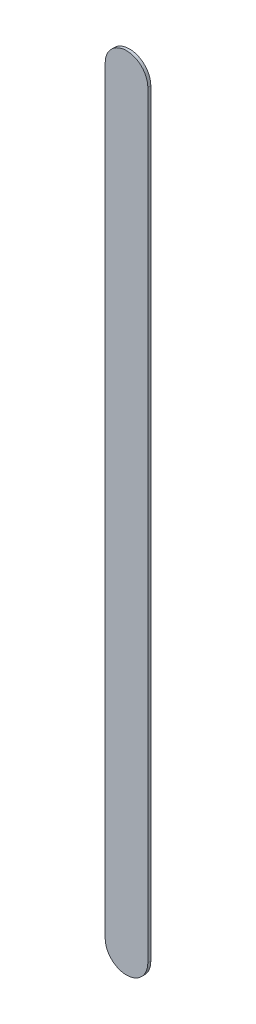
ISO-10303-21;
HEADER;
FILE_DESCRIPTION(('STEP AP214'),'2;1');
FILE_NAME('part.step','',(''),(''),'','','');
FILE_SCHEMA(('AUTOMOTIVE_DESIGN { 1 0 10303 214 1 1 1 1 }'));
ENDSEC;
DATA;
#1=APPLICATION_CONTEXT('core data for automotive mechanical design processes');
#2=APPLICATION_PROTOCOL_DEFINITION('international standard','automotive_design',2000,#1);
#3=PRODUCT_CONTEXT('',#1,'mechanical');
#4=PRODUCT('Part','Part','',(#3));
#5=PRODUCT_RELATED_PRODUCT_CATEGORY('part','',(#4));
#6=PRODUCT_DEFINITION_FORMATION('','',#4);
#7=PRODUCT_DEFINITION_CONTEXT('part definition',#1,'design');
#8=PRODUCT_DEFINITION('design','',#6,#7);
#9=PRODUCT_DEFINITION_SHAPE('','',#8);
#10=(LENGTH_UNIT() NAMED_UNIT(*) SI_UNIT(.MILLI.,.METRE.));
#11=(NAMED_UNIT(*) PLANE_ANGLE_UNIT() SI_UNIT($,.RADIAN.));
#12=(NAMED_UNIT(*) SI_UNIT($,.STERADIAN.) SOLID_ANGLE_UNIT());
#13=UNCERTAINTY_MEASURE_WITH_UNIT(LENGTH_MEASURE(1.E-05),#10,'distance_accuracy_value','');
#14=(GEOMETRIC_REPRESENTATION_CONTEXT(3) GLOBAL_UNCERTAINTY_ASSIGNED_CONTEXT((#13)) GLOBAL_UNIT_ASSIGNED_CONTEXT((#10,
#11,#12)) REPRESENTATION_CONTEXT('',''));
#15=CARTESIAN_POINT('',(0.,0.,0.));
#16=DIRECTION('',(0.,0.,1.));
#17=DIRECTION('',(1.,0.,0.));
#18=AXIS2_PLACEMENT_3D('',#15,#16,#17);
#19=CARTESIAN_POINT('',(164.596,-114.554,0.));
#20=DIRECTION('',(0.,0.,1.));
#21=DIRECTION('',(1.,0.,0.));
#22=AXIS2_PLACEMENT_3D('',#19,#20,#21);
#23=PLANE('',#22);
#24=DIRECTION('',(0.,-1.,0.));
#25=VECTOR('',#24,1.);
#26=CARTESIAN_POINT('',(164.596,-114.554,0.));
#27=LINE('',#26,#25);
#28=CARTESIAN_POINT('',(164.596,-114.554,0.));
#29=VERTEX_POINT('',#28);
#30=CARTESIAN_POINT('',(164.596,-123.444,0.));
#31=VERTEX_POINT('',#30);
#32=EDGE_CURVE('E83',#29,#31,#27,.T.);
#33=ORIENTED_EDGE('',*,*,#32,.T.);
#34=CARTESIAN_POINT('',(164.846,-123.444,0.));
#35=DIRECTION('',(0.,0.,1.));
#36=DIRECTION('',(-1.,0.,0.));
#37=AXIS2_PLACEMENT_3D('',#34,#35,#36);
#38=CIRCLE('',#37,0.25);
#39=CARTESIAN_POINT('',(165.096,-123.444,0.));
#40=VERTEX_POINT('',#39);
#41=EDGE_CURVE('E108',#31,#40,#38,.T.);
#42=ORIENTED_EDGE('',*,*,#41,.T.);
#43=DIRECTION('',(0.,1.,0.));
#44=VECTOR('',#43,1.);
#45=CARTESIAN_POINT('',(165.096,-123.444,0.));
#46=LINE('',#45,#44);
#47=CARTESIAN_POINT('',(165.096,-114.554,0.));
#48=VERTEX_POINT('',#47);
#49=EDGE_CURVE('E75',#40,#48,#46,.T.);
#50=ORIENTED_EDGE('',*,*,#49,.T.);
#51=CARTESIAN_POINT('',(164.846,-114.554,0.));
#52=DIRECTION('',(0.,0.,1.));
#53=DIRECTION('',(1.,0.,0.));
#54=AXIS2_PLACEMENT_3D('',#51,#52,#53);
#55=CIRCLE('',#54,0.25);
#56=EDGE_CURVE('E11',#48,#29,#55,.T.);
#57=ORIENTED_EDGE('',*,*,#56,.T.);
#58=EDGE_LOOP('',(#33,#42,#50,#57));
#59=FACE_BOUND('',#58,.T.);
#60=ADVANCED_FACE('F17',(#59),#23,.T.);
#61=CARTESIAN_POINT('',(164.596,-114.554,-0.035));
#62=DIRECTION('',(0.,0.,1.));
#63=DIRECTION('',(1.,0.,0.));
#64=AXIS2_PLACEMENT_3D('',#61,#62,#63);
#65=PLANE('',#64);
#66=CARTESIAN_POINT('',(164.846,-114.554,-0.035));
#67=DIRECTION('',(0.,0.,1.));
#68=DIRECTION('',(1.,0.,0.));
#69=AXIS2_PLACEMENT_3D('',#66,#67,#68);
#70=CIRCLE('',#69,0.25);
#71=CARTESIAN_POINT('',(165.096,-114.554,-0.035));
#72=VERTEX_POINT('',#71);
#73=CARTESIAN_POINT('',(164.596,-114.554,-0.035));
#74=VERTEX_POINT('',#73);
#75=EDGE_CURVE('E26',#72,#74,#70,.T.);
#76=ORIENTED_EDGE('',*,*,#75,.F.);
#77=DIRECTION('',(0.,1.,0.));
#78=VECTOR('',#77,1.);
#79=CARTESIAN_POINT('',(165.096,-123.444,-0.035));
#80=LINE('',#79,#78);
#81=CARTESIAN_POINT('',(165.096,-123.444,-0.035));
#82=VERTEX_POINT('',#81);
#83=EDGE_CURVE('E105',#82,#72,#80,.T.);
#84=ORIENTED_EDGE('',*,*,#83,.F.);
#85=CARTESIAN_POINT('',(164.846,-123.444,-0.035));
#86=DIRECTION('',(0.,0.,1.));
#87=DIRECTION('',(-1.,0.,0.));
#88=AXIS2_PLACEMENT_3D('',#85,#86,#87);
#89=CIRCLE('',#88,0.25);
#90=CARTESIAN_POINT('',(164.596,-123.444,-0.035));
#91=VERTEX_POINT('',#90);
#92=EDGE_CURVE('E85',#91,#82,#89,.T.);
#93=ORIENTED_EDGE('',*,*,#92,.F.);
#94=DIRECTION('',(0.,-1.,0.));
#95=VECTOR('',#94,1.);
#96=CARTESIAN_POINT('',(164.596,-114.554,-0.035));
#97=LINE('',#96,#95);
#98=EDGE_CURVE('E81',#74,#91,#97,.T.);
#99=ORIENTED_EDGE('',*,*,#98,.F.);
#100=EDGE_LOOP('',(#76,#84,#93,#99));
#101=FACE_BOUND('',#100,.T.);
#102=ADVANCED_FACE('F19',(#101),#65,.F.);
#103=CARTESIAN_POINT('',(164.846,-114.554,-0.035));
#104=DIRECTION('',(0.,0.,-1.));
#105=DIRECTION('',(1.,0.,0.));
#106=AXIS2_PLACEMENT_3D('',#103,#104,#105);
#107=CYLINDRICAL_SURFACE('',#106,0.25);
#108=ORIENTED_EDGE('',*,*,#75,.T.);
#109=DIRECTION('',(0.,0.,1.));
#110=VECTOR('',#109,1.);
#111=CARTESIAN_POINT('',(164.596,-114.554,-0.035));
#112=LINE('',#111,#110);
#113=EDGE_CURVE('E69',#74,#29,#112,.T.);
#114=ORIENTED_EDGE('',*,*,#113,.T.);
#115=ORIENTED_EDGE('',*,*,#56,.F.);
#116=DIRECTION('',(0.,0.,1.));
#117=VECTOR('',#116,1.);
#118=CARTESIAN_POINT('',(165.096,-114.554,-0.035));
#119=LINE('',#118,#117);
#120=EDGE_CURVE('E72',#72,#48,#119,.T.);
#121=ORIENTED_EDGE('',*,*,#120,.F.);
#122=EDGE_LOOP('',(#108,#114,#115,#121));
#123=FACE_BOUND('',#122,.T.);
#124=ADVANCED_FACE('F68',(#123),#107,.T.);
#125=CARTESIAN_POINT('',(165.096,-123.444,-0.035));
#126=DIRECTION('',(-1.,0.,0.));
#127=DIRECTION('',(0.,0.,1.));
#128=AXIS2_PLACEMENT_3D('',#125,#126,#127);
#129=PLANE('',#128);
#130=ORIENTED_EDGE('',*,*,#83,.T.);
#131=ORIENTED_EDGE('',*,*,#120,.T.);
#132=ORIENTED_EDGE('',*,*,#49,.F.);
#133=DIRECTION('',(0.,0.,1.));
#134=VECTOR('',#133,1.);
#135=CARTESIAN_POINT('',(165.096,-123.444,-0.035));
#136=LINE('',#135,#134);
#137=EDGE_CURVE('E104',#82,#40,#136,.T.);
#138=ORIENTED_EDGE('',*,*,#137,.F.);
#139=EDGE_LOOP('',(#130,#131,#132,#138));
#140=FACE_BOUND('',#139,.T.);
#141=ADVANCED_FACE('F118',(#140),#129,.F.);
#142=CARTESIAN_POINT('',(164.846,-123.444,-0.035));
#143=DIRECTION('',(0.,0.,-1.));
#144=DIRECTION('',(-1.,0.,0.));
#145=AXIS2_PLACEMENT_3D('',#142,#143,#144);
#146=CYLINDRICAL_SURFACE('',#145,0.25);
#147=ORIENTED_EDGE('',*,*,#92,.T.);
#148=ORIENTED_EDGE('',*,*,#137,.T.);
#149=ORIENTED_EDGE('',*,*,#41,.F.);
#150=DIRECTION('',(0.,0.,1.));
#151=VECTOR('',#150,1.);
#152=CARTESIAN_POINT('',(164.596,-123.444,-0.035));
#153=LINE('',#152,#151);
#154=EDGE_CURVE('E90',#91,#31,#153,.T.);
#155=ORIENTED_EDGE('',*,*,#154,.F.);
#156=EDGE_LOOP('',(#147,#148,#149,#155));
#157=FACE_BOUND('',#156,.T.);
#158=ADVANCED_FACE('F121',(#157),#146,.T.);
#159=CARTESIAN_POINT('',(164.596,-114.554,-0.035));
#160=DIRECTION('',(1.,0.,0.));
#161=DIRECTION('',(0.,1.,0.));
#162=AXIS2_PLACEMENT_3D('',#159,#160,#161);
#163=PLANE('',#162);
#164=ORIENTED_EDGE('',*,*,#98,.T.);
#165=ORIENTED_EDGE('',*,*,#154,.T.);
#166=ORIENTED_EDGE('',*,*,#32,.F.);
#167=ORIENTED_EDGE('',*,*,#113,.F.);
#168=EDGE_LOOP('',(#164,#165,#166,#167));
#169=FACE_BOUND('',#168,.T.);
#170=ADVANCED_FACE('F79',(#169),#163,.F.);
#171=CLOSED_SHELL('',(#60,#102,#124,#141,#158,#170));
#172=MANIFOLD_SOLID_BREP('B1',#171);
#173=ADVANCED_BREP_SHAPE_REPRESENTATION('',(#18,#172),#14);
#174=SHAPE_DEFINITION_REPRESENTATION(#9,#173);
ENDSEC;
END-ISO-10303-21;
